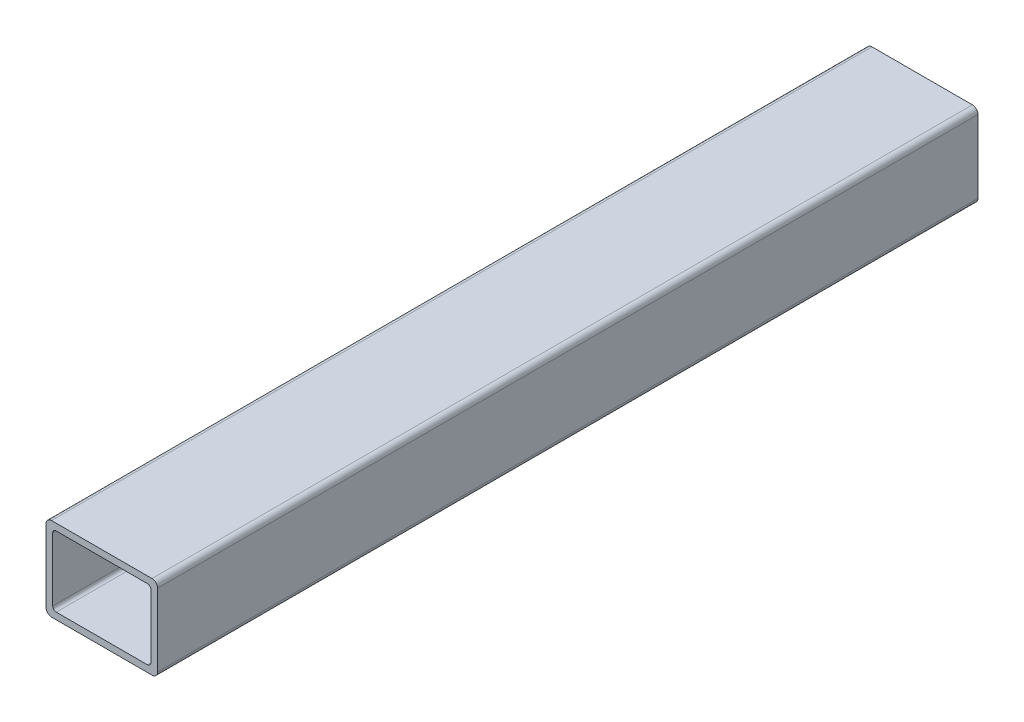
ISO-10303-21;
HEADER;
FILE_DESCRIPTION(('STEP AP214'),'2;1');
FILE_NAME('part.step','',(''),(''),'','','');
FILE_SCHEMA(('AUTOMOTIVE_DESIGN { 1 0 10303 214 1 1 1 1 }'));
ENDSEC;
DATA;
#1=APPLICATION_CONTEXT('core data for automotive mechanical design processes');
#2=APPLICATION_PROTOCOL_DEFINITION('international standard','automotive_design',2000,#1);
#3=PRODUCT_CONTEXT('',#1,'mechanical');
#4=PRODUCT('Part','Part','',(#3));
#5=PRODUCT_RELATED_PRODUCT_CATEGORY('part','',(#4));
#6=PRODUCT_DEFINITION_FORMATION('','',#4);
#7=PRODUCT_DEFINITION_CONTEXT('part definition',#1,'design');
#8=PRODUCT_DEFINITION('design','',#6,#7);
#9=PRODUCT_DEFINITION_SHAPE('','',#8);
#10=(LENGTH_UNIT() NAMED_UNIT(*) SI_UNIT(.MILLI.,.METRE.));
#11=(NAMED_UNIT(*) PLANE_ANGLE_UNIT() SI_UNIT($,.RADIAN.));
#12=(NAMED_UNIT(*) SI_UNIT($,.STERADIAN.) SOLID_ANGLE_UNIT());
#13=UNCERTAINTY_MEASURE_WITH_UNIT(LENGTH_MEASURE(1.E-05),#10,'distance_accuracy_value','');
#14=(GEOMETRIC_REPRESENTATION_CONTEXT(3) GLOBAL_UNCERTAINTY_ASSIGNED_CONTEXT((#13)) GLOBAL_UNIT_ASSIGNED_CONTEXT((#10,
#11,#12)) REPRESENTATION_CONTEXT('',''));
#15=CARTESIAN_POINT('',(0.,0.,0.));
#16=DIRECTION('',(0.,0.,1.));
#17=DIRECTION('',(1.,0.,0.));
#18=AXIS2_PLACEMENT_3D('',#15,#16,#17);
#19=CARTESIAN_POINT('',(22.86,-16.51,373.61368));
#20=DIRECTION('',(0.,0.,1.));
#21=DIRECTION('',(1.,0.,0.));
#22=AXIS2_PLACEMENT_3D('',#19,#20,#21);
#23=PLANE('',#22);
#24=CARTESIAN_POINT('',(22.86,-16.51,373.61368));
#25=DIRECTION('',(0.,0.,1.));
#26=DIRECTION('',(1.,0.,0.));
#27=AXIS2_PLACEMENT_3D('',#24,#25,#26);
#28=CIRCLE('',#27,2.53999999999999);
#29=CARTESIAN_POINT('',(22.86,-19.05,373.61368));
#30=VERTEX_POINT('',#29);
#31=CARTESIAN_POINT('',(25.4,-16.51,373.61368));
#32=VERTEX_POINT('',#31);
#33=EDGE_CURVE('E216',#30,#32,#28,.T.);
#34=ORIENTED_EDGE('',*,*,#33,.T.);
#35=DIRECTION('',(0.,1.,0.));
#36=VECTOR('',#35,1.);
#37=CARTESIAN_POINT('',(25.4,-16.51,373.61368));
#38=LINE('',#37,#36);
#39=CARTESIAN_POINT('',(25.4,16.51,373.61368));
#40=VERTEX_POINT('',#39);
#41=EDGE_CURVE('E219',#32,#40,#38,.T.);
#42=ORIENTED_EDGE('',*,*,#41,.T.);
#43=CARTESIAN_POINT('',(22.86,16.51,373.61368));
#44=DIRECTION('',(0.,0.,1.));
#45=DIRECTION('',(1.,0.,0.));
#46=AXIS2_PLACEMENT_3D('',#43,#44,#45);
#47=CIRCLE('',#46,2.54);
#48=CARTESIAN_POINT('',(22.86,19.05,373.61368));
#49=VERTEX_POINT('',#48);
#50=EDGE_CURVE('E222',#40,#49,#47,.T.);
#51=ORIENTED_EDGE('',*,*,#50,.T.);
#52=DIRECTION('',(-1.,0.,0.));
#53=VECTOR('',#52,1.);
#54=CARTESIAN_POINT('',(22.86,19.05,373.61368));
#55=LINE('',#54,#53);
#56=CARTESIAN_POINT('',(-22.86,19.05,373.61368));
#57=VERTEX_POINT('',#56);
#58=EDGE_CURVE('E224',#49,#57,#55,.T.);
#59=ORIENTED_EDGE('',*,*,#58,.T.);
#60=CARTESIAN_POINT('',(-22.86,16.51,373.61368));
#61=DIRECTION('',(0.,0.,1.));
#62=DIRECTION('',(1.,0.,0.));
#63=AXIS2_PLACEMENT_3D('',#60,#61,#62);
#64=CIRCLE('',#63,2.54);
#65=CARTESIAN_POINT('',(-25.4,16.51,373.61368));
#66=VERTEX_POINT('',#65);
#67=EDGE_CURVE('E226',#57,#66,#64,.T.);
#68=ORIENTED_EDGE('',*,*,#67,.T.);
#69=DIRECTION('',(0.,-1.,0.));
#70=VECTOR('',#69,1.);
#71=CARTESIAN_POINT('',(-25.4,-16.51,373.61368));
#72=LINE('',#71,#70);
#73=CARTESIAN_POINT('',(-25.4,-16.51,373.61368));
#74=VERTEX_POINT('',#73);
#75=EDGE_CURVE('E228',#66,#74,#72,.T.);
#76=ORIENTED_EDGE('',*,*,#75,.T.);
#77=CARTESIAN_POINT('',(-22.86,-16.51,373.61368));
#78=DIRECTION('',(0.,0.,1.));
#79=DIRECTION('',(1.,0.,0.));
#80=AXIS2_PLACEMENT_3D('',#77,#78,#79);
#81=CIRCLE('',#80,2.54);
#82=CARTESIAN_POINT('',(-22.86,-19.05,373.61368));
#83=VERTEX_POINT('',#82);
#84=EDGE_CURVE('E230',#74,#83,#81,.T.);
#85=ORIENTED_EDGE('',*,*,#84,.T.);
#86=DIRECTION('',(1.,0.,0.));
#87=VECTOR('',#86,1.);
#88=CARTESIAN_POINT('',(22.86,-19.05,373.61368));
#89=LINE('',#88,#87);
#90=EDGE_CURVE('E232',#83,#30,#89,.T.);
#91=ORIENTED_EDGE('',*,*,#90,.T.);
#92=EDGE_LOOP('',(#34,#42,#51,#59,#68,#76,#85,#91));
#93=FACE_BOUND('',#92,.T.);
#94=DIRECTION('',(-1.,0.,0.));
#95=VECTOR('',#94,1.);
#96=CARTESIAN_POINT('',(20.7518,16.002,373.61368));
#97=LINE('',#96,#95);
#98=CARTESIAN_POINT('',(20.7518,16.002,373.61368));
#99=VERTEX_POINT('',#98);
#100=CARTESIAN_POINT('',(-20.7518,16.002,373.61368));
#101=VERTEX_POINT('',#100);
#102=EDGE_CURVE('E159',#99,#101,#97,.T.);
#103=ORIENTED_EDGE('',*,*,#102,.F.);
#104=CARTESIAN_POINT('',(20.7518,14.4018,373.61368));
#105=DIRECTION('',(0.,0.,1.));
#106=DIRECTION('',(1.,0.,0.));
#107=AXIS2_PLACEMENT_3D('',#104,#105,#106);
#108=CIRCLE('',#107,1.6002);
#109=CARTESIAN_POINT('',(22.352,14.4018,373.61368));
#110=VERTEX_POINT('',#109);
#111=EDGE_CURVE('E151',#110,#99,#108,.T.);
#112=ORIENTED_EDGE('',*,*,#111,.F.);
#113=DIRECTION('',(0.,1.,0.));
#114=VECTOR('',#113,1.);
#115=CARTESIAN_POINT('',(22.352,14.4018,373.61368));
#116=LINE('',#115,#114);
#117=CARTESIAN_POINT('',(22.352,-14.4018,373.61368));
#118=VERTEX_POINT('',#117);
#119=EDGE_CURVE('E184',#118,#110,#116,.T.);
#120=ORIENTED_EDGE('',*,*,#119,.F.);
#121=CARTESIAN_POINT('',(20.7518,-14.4018,373.61368));
#122=DIRECTION('',(0.,0.,1.));
#123=DIRECTION('',(1.,0.,0.));
#124=AXIS2_PLACEMENT_3D('',#121,#122,#123);
#125=CIRCLE('',#124,1.6002);
#126=CARTESIAN_POINT('',(20.7518,-16.002,373.61368));
#127=VERTEX_POINT('',#126);
#128=EDGE_CURVE('E182',#127,#118,#125,.T.);
#129=ORIENTED_EDGE('',*,*,#128,.F.);
#130=DIRECTION('',(1.,0.,0.));
#131=VECTOR('',#130,1.);
#132=CARTESIAN_POINT('',(20.7518,-16.002,373.61368));
#133=LINE('',#132,#131);
#134=CARTESIAN_POINT('',(-20.7518,-16.002,373.61368));
#135=VERTEX_POINT('',#134);
#136=EDGE_CURVE('E180',#135,#127,#133,.T.);
#137=ORIENTED_EDGE('',*,*,#136,.F.);
#138=CARTESIAN_POINT('',(-20.7518,-14.4018,373.61368));
#139=DIRECTION('',(0.,0.,1.));
#140=DIRECTION('',(1.,0.,0.));
#141=AXIS2_PLACEMENT_3D('',#138,#139,#140);
#142=CIRCLE('',#141,1.6002);
#143=CARTESIAN_POINT('',(-22.352,-14.4018,373.61368));
#144=VERTEX_POINT('',#143);
#145=EDGE_CURVE('E178',#144,#135,#142,.T.);
#146=ORIENTED_EDGE('',*,*,#145,.F.);
#147=DIRECTION('',(0.,-1.,0.));
#148=VECTOR('',#147,1.);
#149=CARTESIAN_POINT('',(-22.352,14.4018,373.61368));
#150=LINE('',#149,#148);
#151=CARTESIAN_POINT('',(-22.352,14.4018,373.61368));
#152=VERTEX_POINT('',#151);
#153=EDGE_CURVE('E174',#152,#144,#150,.T.);
#154=ORIENTED_EDGE('',*,*,#153,.F.);
#155=CARTESIAN_POINT('',(-20.7518,14.4018,373.61368));
#156=DIRECTION('',(0.,0.,1.));
#157=DIRECTION('',(1.,0.,0.));
#158=AXIS2_PLACEMENT_3D('',#155,#156,#157);
#159=CIRCLE('',#158,1.6002);
#160=EDGE_CURVE('E172',#101,#152,#159,.T.);
#161=ORIENTED_EDGE('',*,*,#160,.F.);
#162=EDGE_LOOP('',(#103,#112,#120,#129,#137,#146,#154,#161));
#163=FACE_BOUND('',#162,.T.);
#164=ADVANCED_FACE('F38',(#93,#163),#23,.T.);
#165=CARTESIAN_POINT('',(22.86,-16.51,0.));
#166=DIRECTION('',(0.,0.,1.));
#167=DIRECTION('',(1.,0.,0.));
#168=AXIS2_PLACEMENT_3D('',#165,#166,#167);
#169=PLANE('',#168);
#170=CARTESIAN_POINT('',(22.86,-16.51,0.));
#171=DIRECTION('',(0.,0.,1.));
#172=DIRECTION('',(1.,0.,0.));
#173=AXIS2_PLACEMENT_3D('',#170,#171,#172);
#174=CIRCLE('',#173,2.53999999999999);
#175=CARTESIAN_POINT('',(22.86,-19.05,0.));
#176=VERTEX_POINT('',#175);
#177=CARTESIAN_POINT('',(25.4,-16.51,0.));
#178=VERTEX_POINT('',#177);
#179=EDGE_CURVE('E167',#176,#178,#174,.T.);
#180=ORIENTED_EDGE('',*,*,#179,.F.);
#181=DIRECTION('',(1.,0.,0.));
#182=VECTOR('',#181,1.);
#183=CARTESIAN_POINT('',(22.86,-19.05,0.));
#184=LINE('',#183,#182);
#185=CARTESIAN_POINT('',(-22.86,-19.05,0.));
#186=VERTEX_POINT('',#185);
#187=EDGE_CURVE('E220',#186,#176,#184,.T.);
#188=ORIENTED_EDGE('',*,*,#187,.F.);
#189=CARTESIAN_POINT('',(-22.86,-16.51,0.));
#190=DIRECTION('',(0.,0.,1.));
#191=DIRECTION('',(1.,0.,0.));
#192=AXIS2_PLACEMENT_3D('',#189,#190,#191);
#193=CIRCLE('',#192,2.54);
#194=CARTESIAN_POINT('',(-25.4,-16.51,0.));
#195=VERTEX_POINT('',#194);
#196=EDGE_CURVE('E247',#195,#186,#193,.T.);
#197=ORIENTED_EDGE('',*,*,#196,.F.);
#198=DIRECTION('',(0.,-1.,0.));
#199=VECTOR('',#198,1.);
#200=CARTESIAN_POINT('',(-25.4,-16.51,0.));
#201=LINE('',#200,#199);
#202=CARTESIAN_POINT('',(-25.4,16.51,0.));
#203=VERTEX_POINT('',#202);
#204=EDGE_CURVE('E245',#203,#195,#201,.T.);
#205=ORIENTED_EDGE('',*,*,#204,.F.);
#206=CARTESIAN_POINT('',(-22.86,16.51,0.));
#207=DIRECTION('',(0.,0.,1.));
#208=DIRECTION('',(1.,0.,0.));
#209=AXIS2_PLACEMENT_3D('',#206,#207,#208);
#210=CIRCLE('',#209,2.54);
#211=CARTESIAN_POINT('',(-22.86,19.05,0.));
#212=VERTEX_POINT('',#211);
#213=EDGE_CURVE('E243',#212,#203,#210,.T.);
#214=ORIENTED_EDGE('',*,*,#213,.F.);
#215=DIRECTION('',(-1.,0.,0.));
#216=VECTOR('',#215,1.);
#217=CARTESIAN_POINT('',(22.86,19.05,0.));
#218=LINE('',#217,#216);
#219=CARTESIAN_POINT('',(22.86,19.05,0.));
#220=VERTEX_POINT('',#219);
#221=EDGE_CURVE('E241',#220,#212,#218,.T.);
#222=ORIENTED_EDGE('',*,*,#221,.F.);
#223=CARTESIAN_POINT('',(22.86,16.51,0.));
#224=DIRECTION('',(0.,0.,1.));
#225=DIRECTION('',(1.,0.,0.));
#226=AXIS2_PLACEMENT_3D('',#223,#224,#225);
#227=CIRCLE('',#226,2.54);
#228=CARTESIAN_POINT('',(25.4,16.51,0.));
#229=VERTEX_POINT('',#228);
#230=EDGE_CURVE('E239',#229,#220,#227,.T.);
#231=ORIENTED_EDGE('',*,*,#230,.F.);
#232=DIRECTION('',(0.,1.,0.));
#233=VECTOR('',#232,1.);
#234=CARTESIAN_POINT('',(25.4,-16.51,0.));
#235=LINE('',#234,#233);
#236=EDGE_CURVE('E237',#178,#229,#235,.T.);
#237=ORIENTED_EDGE('',*,*,#236,.F.);
#238=EDGE_LOOP('',(#180,#188,#197,#205,#214,#222,#231,#237));
#239=FACE_BOUND('',#238,.T.);
#240=CARTESIAN_POINT('',(20.7518,14.4018,0.));
#241=DIRECTION('',(0.,0.,1.));
#242=DIRECTION('',(1.,0.,0.));
#243=AXIS2_PLACEMENT_3D('',#240,#241,#242);
#244=CIRCLE('',#243,1.6002);
#245=CARTESIAN_POINT('',(22.352,14.4018,0.));
#246=VERTEX_POINT('',#245);
#247=CARTESIAN_POINT('',(20.7518,16.002,0.));
#248=VERTEX_POINT('',#247);
#249=EDGE_CURVE('E61',#246,#248,#244,.T.);
#250=ORIENTED_EDGE('',*,*,#249,.T.);
#251=DIRECTION('',(-1.,0.,0.));
#252=VECTOR('',#251,1.);
#253=CARTESIAN_POINT('',(20.7518,16.002,0.));
#254=LINE('',#253,#252);
#255=CARTESIAN_POINT('',(-20.7518,16.002,0.));
#256=VERTEX_POINT('',#255);
#257=EDGE_CURVE('E166',#248,#256,#254,.T.);
#258=ORIENTED_EDGE('',*,*,#257,.T.);
#259=CARTESIAN_POINT('',(-20.7518,14.4018,0.));
#260=DIRECTION('',(0.,0.,1.));
#261=DIRECTION('',(1.,0.,0.));
#262=AXIS2_PLACEMENT_3D('',#259,#260,#261);
#263=CIRCLE('',#262,1.6002);
#264=CARTESIAN_POINT('',(-22.352,14.4018,0.));
#265=VERTEX_POINT('',#264);
#266=EDGE_CURVE('E188',#256,#265,#263,.T.);
#267=ORIENTED_EDGE('',*,*,#266,.T.);
#268=DIRECTION('',(0.,-1.,0.));
#269=VECTOR('',#268,1.);
#270=CARTESIAN_POINT('',(-22.352,14.4018,0.));
#271=LINE('',#270,#269);
#272=CARTESIAN_POINT('',(-22.352,-14.4018,0.));
#273=VERTEX_POINT('',#272);
#274=EDGE_CURVE('E191',#265,#273,#271,.T.);
#275=ORIENTED_EDGE('',*,*,#274,.T.);
#276=CARTESIAN_POINT('',(-20.7518,-14.4018,0.));
#277=DIRECTION('',(0.,0.,1.));
#278=DIRECTION('',(1.,0.,0.));
#279=AXIS2_PLACEMENT_3D('',#276,#277,#278);
#280=CIRCLE('',#279,1.6002);
#281=CARTESIAN_POINT('',(-20.7518,-16.002,0.));
#282=VERTEX_POINT('',#281);
#283=EDGE_CURVE('E194',#273,#282,#280,.T.);
#284=ORIENTED_EDGE('',*,*,#283,.T.);
#285=DIRECTION('',(1.,0.,0.));
#286=VECTOR('',#285,1.);
#287=CARTESIAN_POINT('',(20.7518,-16.002,0.));
#288=LINE('',#287,#286);
#289=CARTESIAN_POINT('',(20.7518,-16.002,0.));
#290=VERTEX_POINT('',#289);
#291=EDGE_CURVE('E197',#282,#290,#288,.T.);
#292=ORIENTED_EDGE('',*,*,#291,.T.);
#293=CARTESIAN_POINT('',(20.7518,-14.4018,0.));
#294=DIRECTION('',(0.,0.,1.));
#295=DIRECTION('',(1.,0.,0.));
#296=AXIS2_PLACEMENT_3D('',#293,#294,#295);
#297=CIRCLE('',#296,1.6002);
#298=CARTESIAN_POINT('',(22.352,-14.4018,0.));
#299=VERTEX_POINT('',#298);
#300=EDGE_CURVE('E200',#290,#299,#297,.T.);
#301=ORIENTED_EDGE('',*,*,#300,.T.);
#302=DIRECTION('',(0.,1.,0.));
#303=VECTOR('',#302,1.);
#304=CARTESIAN_POINT('',(22.352,14.4018,0.));
#305=LINE('',#304,#303);
#306=EDGE_CURVE('E160',#299,#246,#305,.T.);
#307=ORIENTED_EDGE('',*,*,#306,.T.);
#308=EDGE_LOOP('',(#250,#258,#267,#275,#284,#292,#301,#307));
#309=FACE_BOUND('',#308,.T.);
#310=ADVANCED_FACE('F277',(#239,#309),#169,.F.);
#311=CARTESIAN_POINT('',(22.86,-16.51,373.61368));
#312=DIRECTION('',(0.,0.,-1.));
#313=DIRECTION('',(-1.,0.,0.));
#314=AXIS2_PLACEMENT_3D('',#311,#312,#313);
#315=CYLINDRICAL_SURFACE('',#314,2.53999999999999);
#316=ORIENTED_EDGE('',*,*,#179,.T.);
#317=DIRECTION('',(0.,0.,-1.));
#318=VECTOR('',#317,1.);
#319=CARTESIAN_POINT('',(25.4,-16.51,373.61368));
#320=LINE('',#319,#318);
#321=EDGE_CURVE('E11',#32,#178,#320,.T.);
#322=ORIENTED_EDGE('',*,*,#321,.F.);
#323=ORIENTED_EDGE('',*,*,#33,.F.);
#324=DIRECTION('',(0.,0.,-1.));
#325=VECTOR('',#324,1.);
#326=CARTESIAN_POINT('',(22.86,-19.05,373.61368));
#327=LINE('',#326,#325);
#328=EDGE_CURVE('E234',#30,#176,#327,.T.);
#329=ORIENTED_EDGE('',*,*,#328,.T.);
#330=EDGE_LOOP('',(#316,#322,#323,#329));
#331=FACE_BOUND('',#330,.T.);
#332=ADVANCED_FACE('F40',(#331),#315,.T.);
#333=CARTESIAN_POINT('',(25.4,-16.51,373.61368));
#334=DIRECTION('',(-1.,0.,0.));
#335=DIRECTION('',(0.,0.,1.));
#336=AXIS2_PLACEMENT_3D('',#333,#334,#335);
#337=PLANE('',#336);
#338=ORIENTED_EDGE('',*,*,#236,.T.);
#339=DIRECTION('',(0.,0.,-1.));
#340=VECTOR('',#339,1.);
#341=CARTESIAN_POINT('',(25.4,16.51,373.61368));
#342=LINE('',#341,#340);
#343=EDGE_CURVE('E46',#40,#229,#342,.T.);
#344=ORIENTED_EDGE('',*,*,#343,.F.);
#345=ORIENTED_EDGE('',*,*,#41,.F.);
#346=ORIENTED_EDGE('',*,*,#321,.T.);
#347=EDGE_LOOP('',(#338,#344,#345,#346));
#348=FACE_BOUND('',#347,.T.);
#349=ADVANCED_FACE('F294',(#348),#337,.F.);
#350=CARTESIAN_POINT('',(22.86,16.51,373.61368));
#351=DIRECTION('',(0.,0.,-1.));
#352=DIRECTION('',(-1.,0.,0.));
#353=AXIS2_PLACEMENT_3D('',#350,#351,#352);
#354=CYLINDRICAL_SURFACE('',#353,2.54);
#355=ORIENTED_EDGE('',*,*,#230,.T.);
#356=DIRECTION('',(0.,0.,-1.));
#357=VECTOR('',#356,1.);
#358=CARTESIAN_POINT('',(22.86,19.05,373.61368));
#359=LINE('',#358,#357);
#360=EDGE_CURVE('E264',#49,#220,#359,.T.);
#361=ORIENTED_EDGE('',*,*,#360,.F.);
#362=ORIENTED_EDGE('',*,*,#50,.F.);
#363=ORIENTED_EDGE('',*,*,#343,.T.);
#364=EDGE_LOOP('',(#355,#361,#362,#363));
#365=FACE_BOUND('',#364,.T.);
#366=ADVANCED_FACE('F271',(#365),#354,.T.);
#367=CARTESIAN_POINT('',(22.86,19.05,373.61368));
#368=DIRECTION('',(0.,-1.,0.));
#369=DIRECTION('',(0.,0.,-1.));
#370=AXIS2_PLACEMENT_3D('',#367,#368,#369);
#371=PLANE('',#370);
#372=ORIENTED_EDGE('',*,*,#221,.T.);
#373=DIRECTION('',(0.,0.,-1.));
#374=VECTOR('',#373,1.);
#375=CARTESIAN_POINT('',(-22.86,19.05,373.61368));
#376=LINE('',#375,#374);
#377=EDGE_CURVE('E261',#57,#212,#376,.T.);
#378=ORIENTED_EDGE('',*,*,#377,.F.);
#379=ORIENTED_EDGE('',*,*,#58,.F.);
#380=ORIENTED_EDGE('',*,*,#360,.T.);
#381=EDGE_LOOP('',(#372,#378,#379,#380));
#382=FACE_BOUND('',#381,.T.);
#383=ADVANCED_FACE('F283',(#382),#371,.F.);
#384=CARTESIAN_POINT('',(-22.86,16.51,373.61368));
#385=DIRECTION('',(0.,0.,-1.));
#386=DIRECTION('',(-1.,0.,0.));
#387=AXIS2_PLACEMENT_3D('',#384,#385,#386);
#388=CYLINDRICAL_SURFACE('',#387,2.54);
#389=ORIENTED_EDGE('',*,*,#213,.T.);
#390=DIRECTION('',(0.,0.,-1.));
#391=VECTOR('',#390,1.);
#392=CARTESIAN_POINT('',(-25.4,16.51,373.61368));
#393=LINE('',#392,#391);
#394=EDGE_CURVE('E258',#66,#203,#393,.T.);
#395=ORIENTED_EDGE('',*,*,#394,.F.);
#396=ORIENTED_EDGE('',*,*,#67,.F.);
#397=ORIENTED_EDGE('',*,*,#377,.T.);
#398=EDGE_LOOP('',(#389,#395,#396,#397));
#399=FACE_BOUND('',#398,.T.);
#400=ADVANCED_FACE('F287',(#399),#388,.T.);
#401=CARTESIAN_POINT('',(-25.4,-16.51,373.61368));
#402=DIRECTION('',(1.,0.,0.));
#403=DIRECTION('',(0.,1.,0.));
#404=AXIS2_PLACEMENT_3D('',#401,#402,#403);
#405=PLANE('',#404);
#406=ORIENTED_EDGE('',*,*,#204,.T.);
#407=DIRECTION('',(0.,0.,-1.));
#408=VECTOR('',#407,1.);
#409=CARTESIAN_POINT('',(-25.4,-16.51,373.61368));
#410=LINE('',#409,#408);
#411=EDGE_CURVE('E255',#74,#195,#410,.T.);
#412=ORIENTED_EDGE('',*,*,#411,.F.);
#413=ORIENTED_EDGE('',*,*,#75,.F.);
#414=ORIENTED_EDGE('',*,*,#394,.T.);
#415=EDGE_LOOP('',(#406,#412,#413,#414));
#416=FACE_BOUND('',#415,.T.);
#417=ADVANCED_FACE('F307',(#416),#405,.F.);
#418=CARTESIAN_POINT('',(-22.86,-16.51,373.61368));
#419=DIRECTION('',(0.,0.,-1.));
#420=DIRECTION('',(-1.,0.,0.));
#421=AXIS2_PLACEMENT_3D('',#418,#419,#420);
#422=CYLINDRICAL_SURFACE('',#421,2.54);
#423=ORIENTED_EDGE('',*,*,#196,.T.);
#424=DIRECTION('',(0.,0.,-1.));
#425=VECTOR('',#424,1.);
#426=CARTESIAN_POINT('',(-22.86,-19.05,373.61368));
#427=LINE('',#426,#425);
#428=EDGE_CURVE('E252',#83,#186,#427,.T.);
#429=ORIENTED_EDGE('',*,*,#428,.F.);
#430=ORIENTED_EDGE('',*,*,#84,.F.);
#431=ORIENTED_EDGE('',*,*,#411,.T.);
#432=EDGE_LOOP('',(#423,#429,#430,#431));
#433=FACE_BOUND('',#432,.T.);
#434=ADVANCED_FACE('F305',(#433),#422,.T.);
#435=CARTESIAN_POINT('',(22.86,-19.05,373.61368));
#436=DIRECTION('',(0.,1.,0.));
#437=DIRECTION('',(-1.,0.,0.));
#438=AXIS2_PLACEMENT_3D('',#435,#436,#437);
#439=PLANE('',#438);
#440=ORIENTED_EDGE('',*,*,#187,.T.);
#441=ORIENTED_EDGE('',*,*,#328,.F.);
#442=ORIENTED_EDGE('',*,*,#90,.F.);
#443=ORIENTED_EDGE('',*,*,#428,.T.);
#444=EDGE_LOOP('',(#440,#441,#442,#443));
#445=FACE_BOUND('',#444,.T.);
#446=ADVANCED_FACE('F300',(#445),#439,.F.);
#447=CARTESIAN_POINT('',(20.7518,14.4018,373.61368));
#448=DIRECTION('',(0.,0.,-1.));
#449=DIRECTION('',(-1.,0.,0.));
#450=AXIS2_PLACEMENT_3D('',#447,#448,#449);
#451=CYLINDRICAL_SURFACE('',#450,1.6002);
#452=ORIENTED_EDGE('',*,*,#249,.F.);
#453=DIRECTION('',(0.,0.,-1.));
#454=VECTOR('',#453,1.);
#455=CARTESIAN_POINT('',(22.352,14.4018,373.61368));
#456=LINE('',#455,#454);
#457=EDGE_CURVE('E155',#110,#246,#456,.T.);
#458=ORIENTED_EDGE('',*,*,#457,.F.);
#459=ORIENTED_EDGE('',*,*,#111,.T.);
#460=DIRECTION('',(0.,0.,-1.));
#461=VECTOR('',#460,1.);
#462=CARTESIAN_POINT('',(20.7518,16.002,373.61368));
#463=LINE('',#462,#461);
#464=EDGE_CURVE('E154',#99,#248,#463,.T.);
#465=ORIENTED_EDGE('',*,*,#464,.T.);
#466=EDGE_LOOP('',(#452,#458,#459,#465));
#467=FACE_BOUND('',#466,.T.);
#468=ADVANCED_FACE('F153',(#467),#451,.F.);
#469=CARTESIAN_POINT('',(20.7518,16.002,373.61368));
#470=DIRECTION('',(0.,-1.,0.));
#471=DIRECTION('',(1.,0.,0.));
#472=AXIS2_PLACEMENT_3D('',#469,#470,#471);
#473=PLANE('',#472);
#474=ORIENTED_EDGE('',*,*,#257,.F.);
#475=ORIENTED_EDGE('',*,*,#464,.F.);
#476=ORIENTED_EDGE('',*,*,#102,.T.);
#477=DIRECTION('',(0.,0.,-1.));
#478=VECTOR('',#477,1.);
#479=CARTESIAN_POINT('',(-20.7518,16.002,373.61368));
#480=LINE('',#479,#478);
#481=EDGE_CURVE('E168',#101,#256,#480,.T.);
#482=ORIENTED_EDGE('',*,*,#481,.T.);
#483=EDGE_LOOP('',(#474,#475,#476,#482));
#484=FACE_BOUND('',#483,.T.);
#485=ADVANCED_FACE('F163',(#484),#473,.T.);
#486=CARTESIAN_POINT('',(-20.7518,14.4018,373.61368));
#487=DIRECTION('',(0.,0.,-1.));
#488=DIRECTION('',(-1.,0.,0.));
#489=AXIS2_PLACEMENT_3D('',#486,#487,#488);
#490=CYLINDRICAL_SURFACE('',#489,1.6002);
#491=ORIENTED_EDGE('',*,*,#266,.F.);
#492=ORIENTED_EDGE('',*,*,#481,.F.);
#493=ORIENTED_EDGE('',*,*,#160,.T.);
#494=DIRECTION('',(0.,0.,-1.));
#495=VECTOR('',#494,1.);
#496=CARTESIAN_POINT('',(-22.352,14.4018,373.61368));
#497=LINE('',#496,#495);
#498=EDGE_CURVE('E213',#152,#265,#497,.T.);
#499=ORIENTED_EDGE('',*,*,#498,.T.);
#500=EDGE_LOOP('',(#491,#492,#493,#499));
#501=FACE_BOUND('',#500,.T.);
#502=ADVANCED_FACE('F332',(#501),#490,.F.);
#503=CARTESIAN_POINT('',(-22.352,14.4018,373.61368));
#504=DIRECTION('',(1.,0.,0.));
#505=DIRECTION('',(0.,1.,0.));
#506=AXIS2_PLACEMENT_3D('',#503,#504,#505);
#507=PLANE('',#506);
#508=ORIENTED_EDGE('',*,*,#274,.F.);
#509=ORIENTED_EDGE('',*,*,#498,.F.);
#510=ORIENTED_EDGE('',*,*,#153,.T.);
#511=DIRECTION('',(0.,0.,-1.));
#512=VECTOR('',#511,1.);
#513=CARTESIAN_POINT('',(-22.352,-14.4018,373.61368));
#514=LINE('',#513,#512);
#515=EDGE_CURVE('E211',#144,#273,#514,.T.);
#516=ORIENTED_EDGE('',*,*,#515,.T.);
#517=EDGE_LOOP('',(#508,#509,#510,#516));
#518=FACE_BOUND('',#517,.T.);
#519=ADVANCED_FACE('F336',(#518),#507,.T.);
#520=CARTESIAN_POINT('',(-20.7518,-14.4018,373.61368));
#521=DIRECTION('',(0.,0.,-1.));
#522=DIRECTION('',(-1.,0.,0.));
#523=AXIS2_PLACEMENT_3D('',#520,#521,#522);
#524=CYLINDRICAL_SURFACE('',#523,1.6002);
#525=ORIENTED_EDGE('',*,*,#283,.F.);
#526=ORIENTED_EDGE('',*,*,#515,.F.);
#527=ORIENTED_EDGE('',*,*,#145,.T.);
#528=DIRECTION('',(0.,0.,-1.));
#529=VECTOR('',#528,1.);
#530=CARTESIAN_POINT('',(-20.7518,-16.002,373.61368));
#531=LINE('',#530,#529);
#532=EDGE_CURVE('E209',#135,#282,#531,.T.);
#533=ORIENTED_EDGE('',*,*,#532,.T.);
#534=EDGE_LOOP('',(#525,#526,#527,#533));
#535=FACE_BOUND('',#534,.T.);
#536=ADVANCED_FACE('F342',(#535),#524,.F.);
#537=CARTESIAN_POINT('',(20.7518,-16.002,373.61368));
#538=DIRECTION('',(0.,1.,0.));
#539=DIRECTION('',(-1.,0.,0.));
#540=AXIS2_PLACEMENT_3D('',#537,#538,#539);
#541=PLANE('',#540);
#542=ORIENTED_EDGE('',*,*,#291,.F.);
#543=ORIENTED_EDGE('',*,*,#532,.F.);
#544=ORIENTED_EDGE('',*,*,#136,.T.);
#545=DIRECTION('',(0.,0.,-1.));
#546=VECTOR('',#545,1.);
#547=CARTESIAN_POINT('',(20.7518,-16.002,373.61368));
#548=LINE('',#547,#546);
#549=EDGE_CURVE('E207',#127,#290,#548,.T.);
#550=ORIENTED_EDGE('',*,*,#549,.T.);
#551=EDGE_LOOP('',(#542,#543,#544,#550));
#552=FACE_BOUND('',#551,.T.);
#553=ADVANCED_FACE('F346',(#552),#541,.T.);
#554=CARTESIAN_POINT('',(20.7518,-14.4018,373.61368));
#555=DIRECTION('',(0.,0.,-1.));
#556=DIRECTION('',(-1.,0.,0.));
#557=AXIS2_PLACEMENT_3D('',#554,#555,#556);
#558=CYLINDRICAL_SURFACE('',#557,1.6002);
#559=ORIENTED_EDGE('',*,*,#300,.F.);
#560=ORIENTED_EDGE('',*,*,#549,.F.);
#561=ORIENTED_EDGE('',*,*,#128,.T.);
#562=DIRECTION('',(0.,0.,-1.));
#563=VECTOR('',#562,1.);
#564=CARTESIAN_POINT('',(22.352,-14.4018,373.61368));
#565=LINE('',#564,#563);
#566=EDGE_CURVE('E53',#118,#299,#565,.T.);
#567=ORIENTED_EDGE('',*,*,#566,.T.);
#568=EDGE_LOOP('',(#559,#560,#561,#567));
#569=FACE_BOUND('',#568,.T.);
#570=ADVANCED_FACE('F350',(#569),#558,.F.);
#571=CARTESIAN_POINT('',(22.352,14.4018,373.61368));
#572=DIRECTION('',(-1.,0.,0.));
#573=DIRECTION('',(0.,-1.,0.));
#574=AXIS2_PLACEMENT_3D('',#571,#572,#573);
#575=PLANE('',#574);
#576=ORIENTED_EDGE('',*,*,#306,.F.);
#577=ORIENTED_EDGE('',*,*,#566,.F.);
#578=ORIENTED_EDGE('',*,*,#119,.T.);
#579=ORIENTED_EDGE('',*,*,#457,.T.);
#580=EDGE_LOOP('',(#576,#577,#578,#579));
#581=FACE_BOUND('',#580,.T.);
#582=ADVANCED_FACE('F354',(#581),#575,.T.);
#583=CLOSED_SHELL('',(#164,#310,#332,#349,#366,#383,#400,#417,#434,#446,#468,#485,#502,#519,
#536,#553,#570,#582));
#584=MANIFOLD_SOLID_BREP('B2',#583);
#585=ADVANCED_BREP_SHAPE_REPRESENTATION('',(#18,#584),#14);
#586=SHAPE_DEFINITION_REPRESENTATION(#9,#585);
ENDSEC;
END-ISO-10303-21;
